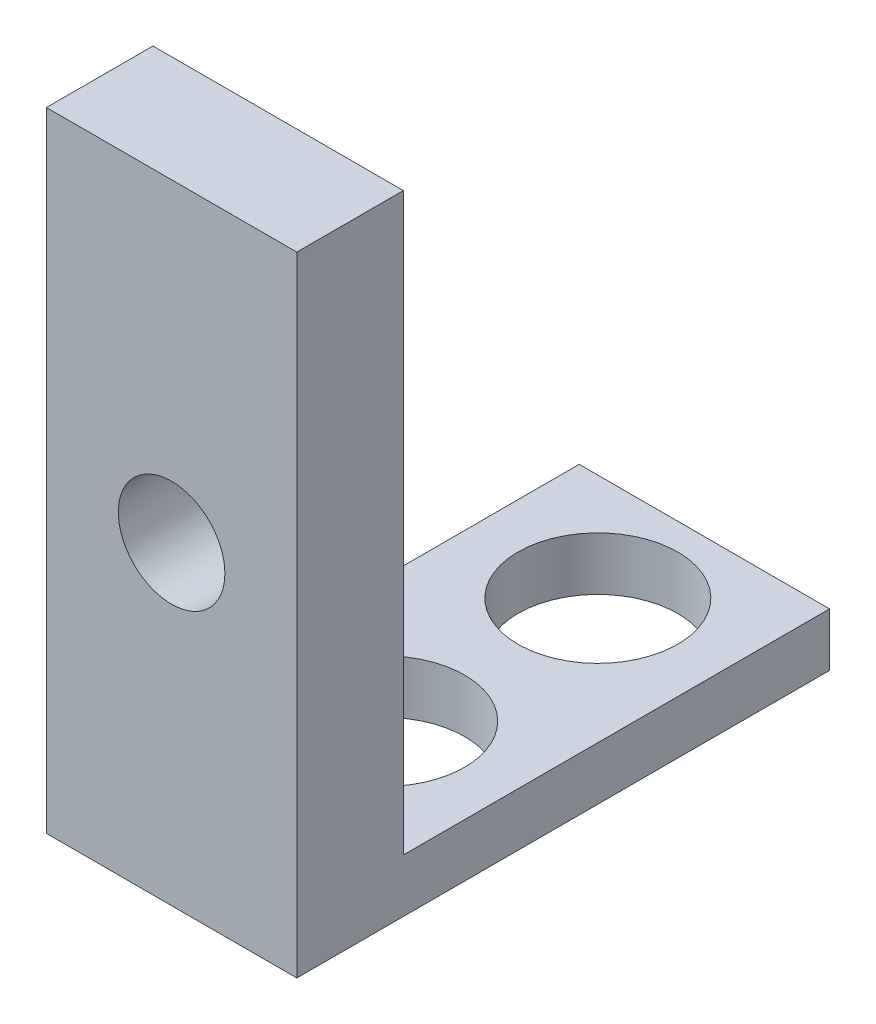
ISO-10303-21;
HEADER;
FILE_DESCRIPTION(('STEP AP214'),'2;1');
FILE_NAME('part.step','',(''),(''),'','','');
FILE_SCHEMA(('AUTOMOTIVE_DESIGN { 1 0 10303 214 1 1 1 1 }'));
ENDSEC;
DATA;
#1=APPLICATION_CONTEXT('core data for automotive mechanical design processes');
#2=APPLICATION_PROTOCOL_DEFINITION('international standard','automotive_design',2000,#1);
#3=PRODUCT_CONTEXT('',#1,'mechanical');
#4=PRODUCT('Part','Part','',(#3));
#5=PRODUCT_RELATED_PRODUCT_CATEGORY('part','',(#4));
#6=PRODUCT_DEFINITION_FORMATION('','',#4);
#7=PRODUCT_DEFINITION_CONTEXT('part definition',#1,'design');
#8=PRODUCT_DEFINITION('design','',#6,#7);
#9=PRODUCT_DEFINITION_SHAPE('','',#8);
#10=(LENGTH_UNIT() NAMED_UNIT(*) SI_UNIT(.MILLI.,.METRE.));
#11=(NAMED_UNIT(*) PLANE_ANGLE_UNIT() SI_UNIT($,.RADIAN.));
#12=(NAMED_UNIT(*) SI_UNIT($,.STERADIAN.) SOLID_ANGLE_UNIT());
#13=UNCERTAINTY_MEASURE_WITH_UNIT(LENGTH_MEASURE(1.E-05),#10,'distance_accuracy_value','');
#14=(GEOMETRIC_REPRESENTATION_CONTEXT(3) GLOBAL_UNCERTAINTY_ASSIGNED_CONTEXT((#13)) GLOBAL_UNIT_ASSIGNED_CONTEXT((#10,
#11,#12)) REPRESENTATION_CONTEXT('',''));
#15=CARTESIAN_POINT('',(0.,0.,0.));
#16=DIRECTION('',(0.,0.,1.));
#17=DIRECTION('',(1.,0.,0.));
#18=AXIS2_PLACEMENT_3D('',#15,#16,#17);
#19=CARTESIAN_POINT('',(0.,0.,0.));
#20=DIRECTION('',(0.,0.,1.));
#21=DIRECTION('',(1.,0.,0.));
#22=AXIS2_PLACEMENT_3D('',#19,#20,#21);
#23=PLANE('',#22);
#24=CARTESIAN_POINT('',(2.34999999999998,5.9,0.));
#25=DIRECTION('',(0.,0.,1.));
#26=DIRECTION('',(1.,0.,0.));
#27=AXIS2_PLACEMENT_3D('',#24,#25,#26);
#28=CIRCLE('',#27,1.);
#29=CARTESIAN_POINT('',(3.34999999999998,5.9,0.));
#30=VERTEX_POINT('',#29);
#31=EDGE_CURVE('E126',#30,#30,#28,.T.);
#32=ORIENTED_EDGE('',*,*,#31,.T.);
#33=EDGE_LOOP('',(#32));
#34=FACE_BOUND('',#33,.T.);
#35=DIRECTION('',(1.,0.,0.));
#36=VECTOR('',#35,1.);
#37=CARTESIAN_POINT('',(4.7,1.,0.));
#38=LINE('',#37,#36);
#39=CARTESIAN_POINT('',(0.,1.,0.));
#40=VERTEX_POINT('',#39);
#41=CARTESIAN_POINT('',(4.7,1.,0.));
#42=VERTEX_POINT('',#41);
#43=EDGE_CURVE('E48',#40,#42,#38,.T.);
#44=ORIENTED_EDGE('',*,*,#43,.F.);
#45=DIRECTION('',(0.,-1.,0.));
#46=VECTOR('',#45,1.);
#47=CARTESIAN_POINT('',(0.,0.,0.));
#48=LINE('',#47,#46);
#49=CARTESIAN_POINT('',(0.,11.8,0.));
#50=VERTEX_POINT('',#49);
#51=EDGE_CURVE('E135',#50,#40,#48,.T.);
#52=ORIENTED_EDGE('',*,*,#51,.F.);
#53=DIRECTION('',(-1.,0.,0.));
#54=VECTOR('',#53,1.);
#55=CARTESIAN_POINT('',(4.7,11.8,0.));
#56=LINE('',#55,#54);
#57=CARTESIAN_POINT('',(4.7,11.8,0.));
#58=VERTEX_POINT('',#57);
#59=EDGE_CURVE('E73',#58,#50,#56,.T.);
#60=ORIENTED_EDGE('',*,*,#59,.F.);
#61=DIRECTION('',(0.,1.,0.));
#62=VECTOR('',#61,1.);
#63=CARTESIAN_POINT('',(4.7,0.,0.));
#64=LINE('',#63,#62);
#65=EDGE_CURVE('E130',#42,#58,#64,.T.);
#66=ORIENTED_EDGE('',*,*,#65,.F.);
#67=EDGE_LOOP('',(#44,#52,#60,#66));
#68=FACE_BOUND('',#67,.T.);
#69=ADVANCED_FACE('F33',(#34,#68),#23,.F.);
#70=CARTESIAN_POINT('',(0.,0.,2.));
#71=DIRECTION('',(0.,0.,1.));
#72=DIRECTION('',(1.,0.,0.));
#73=AXIS2_PLACEMENT_3D('',#70,#71,#72);
#74=PLANE('',#73);
#75=DIRECTION('',(1.,0.,0.));
#76=VECTOR('',#75,1.);
#77=CARTESIAN_POINT('',(0.,0.,2.));
#78=LINE('',#77,#76);
#79=CARTESIAN_POINT('',(0.,0.,2.));
#80=VERTEX_POINT('',#79);
#81=CARTESIAN_POINT('',(4.7,0.,2.));
#82=VERTEX_POINT('',#81);
#83=EDGE_CURVE('E133',#80,#82,#78,.T.);
#84=ORIENTED_EDGE('',*,*,#83,.T.);
#85=DIRECTION('',(0.,1.,0.));
#86=VECTOR('',#85,1.);
#87=CARTESIAN_POINT('',(4.7,0.,2.));
#88=LINE('',#87,#86);
#89=CARTESIAN_POINT('',(4.7,11.8,2.));
#90=VERTEX_POINT('',#89);
#91=EDGE_CURVE('E80',#82,#90,#88,.T.);
#92=ORIENTED_EDGE('',*,*,#91,.T.);
#93=DIRECTION('',(-1.,0.,0.));
#94=VECTOR('',#93,1.);
#95=CARTESIAN_POINT('',(4.7,11.8,2.));
#96=LINE('',#95,#94);
#97=CARTESIAN_POINT('',(0.,11.8,2.));
#98=VERTEX_POINT('',#97);
#99=EDGE_CURVE('E137',#90,#98,#96,.T.);
#100=ORIENTED_EDGE('',*,*,#99,.T.);
#101=DIRECTION('',(0.,-1.,0.));
#102=VECTOR('',#101,1.);
#103=CARTESIAN_POINT('',(0.,0.,2.));
#104=LINE('',#103,#102);
#105=EDGE_CURVE('E57',#98,#80,#104,.T.);
#106=ORIENTED_EDGE('',*,*,#105,.T.);
#107=EDGE_LOOP('',(#84,#92,#100,#106));
#108=FACE_BOUND('',#107,.T.);
#109=CARTESIAN_POINT('',(2.34999999999998,5.9,2.));
#110=DIRECTION('',(0.,0.,1.));
#111=DIRECTION('',(1.,0.,0.));
#112=AXIS2_PLACEMENT_3D('',#109,#110,#111);
#113=CIRCLE('',#112,1.);
#114=CARTESIAN_POINT('',(3.34999999999998,5.9,2.));
#115=VERTEX_POINT('',#114);
#116=EDGE_CURVE('E127',#115,#115,#113,.T.);
#117=ORIENTED_EDGE('',*,*,#116,.F.);
#118=EDGE_LOOP('',(#117));
#119=FACE_BOUND('',#118,.T.);
#120=ADVANCED_FACE('F167',(#108,#119),#74,.T.);
#121=CARTESIAN_POINT('',(0.,0.,2.));
#122=DIRECTION('',(0.,1.,0.));
#123=DIRECTION('',(0.,0.,1.));
#124=AXIS2_PLACEMENT_3D('',#121,#122,#123);
#125=PLANE('',#124);
#126=CARTESIAN_POINT('',(2.34999999999998,0.,-2.));
#127=DIRECTION('',(0.,1.,0.));
#128=DIRECTION('',(0.,0.,1.));
#129=AXIS2_PLACEMENT_3D('',#126,#127,#128);
#130=CIRCLE('',#129,1.5);
#131=CARTESIAN_POINT('',(2.34999999999998,0.,-0.5));
#132=VERTEX_POINT('',#131);
#133=EDGE_CURVE('E114',#132,#132,#130,.T.);
#134=ORIENTED_EDGE('',*,*,#133,.T.);
#135=EDGE_LOOP('',(#134));
#136=FACE_BOUND('',#135,.T.);
#137=CARTESIAN_POINT('',(2.34999999999998,0.,-6.));
#138=DIRECTION('',(0.,1.,0.));
#139=DIRECTION('',(0.,0.,1.));
#140=AXIS2_PLACEMENT_3D('',#137,#138,#139);
#141=CIRCLE('',#140,1.5);
#142=CARTESIAN_POINT('',(2.34999999999998,0.,-4.5));
#143=VERTEX_POINT('',#142);
#144=EDGE_CURVE('E190',#143,#143,#141,.T.);
#145=ORIENTED_EDGE('',*,*,#144,.T.);
#146=EDGE_LOOP('',(#145));
#147=FACE_BOUND('',#146,.T.);
#148=DIRECTION('',(0.,0.,-1.));
#149=VECTOR('',#148,1.);
#150=CARTESIAN_POINT('',(0.,0.,2.));
#151=LINE('',#150,#149);
#152=CARTESIAN_POINT('',(0.,0.,-8.));
#153=VERTEX_POINT('',#152);
#154=EDGE_CURVE('E104',#80,#153,#151,.T.);
#155=ORIENTED_EDGE('',*,*,#154,.T.);
#156=DIRECTION('',(-1.,0.,0.));
#157=VECTOR('',#156,1.);
#158=CARTESIAN_POINT('',(4.7,0.,-8.));
#159=LINE('',#158,#157);
#160=CARTESIAN_POINT('',(4.7,0.,-8.));
#161=VERTEX_POINT('',#160);
#162=EDGE_CURVE('E103',#161,#153,#159,.T.);
#163=ORIENTED_EDGE('',*,*,#162,.F.);
#164=DIRECTION('',(0.,0.,-1.));
#165=VECTOR('',#164,1.);
#166=CARTESIAN_POINT('',(4.7,0.,2.));
#167=LINE('',#166,#165);
#168=EDGE_CURVE('E11',#82,#161,#167,.T.);
#169=ORIENTED_EDGE('',*,*,#168,.F.);
#170=ORIENTED_EDGE('',*,*,#83,.F.);
#171=EDGE_LOOP('',(#155,#163,#169,#170));
#172=FACE_BOUND('',#171,.T.);
#173=ADVANCED_FACE('F35',(#136,#147,#172),#125,.F.);
#174=CARTESIAN_POINT('',(4.7,0.,2.));
#175=DIRECTION('',(-1.,0.,0.));
#176=DIRECTION('',(0.,0.,1.));
#177=AXIS2_PLACEMENT_3D('',#174,#175,#176);
#178=PLANE('',#177);
#179=ORIENTED_EDGE('',*,*,#168,.T.);
#180=DIRECTION('',(0.,-1.,0.));
#181=VECTOR('',#180,1.);
#182=CARTESIAN_POINT('',(4.7,0.,-8.));
#183=LINE('',#182,#181);
#184=CARTESIAN_POINT('',(4.7,1.,-8.));
#185=VERTEX_POINT('',#184);
#186=EDGE_CURVE('E99',#185,#161,#183,.T.);
#187=ORIENTED_EDGE('',*,*,#186,.F.);
#188=DIRECTION('',(0.,0.,1.));
#189=VECTOR('',#188,1.);
#190=CARTESIAN_POINT('',(4.7,1.,-8.));
#191=LINE('',#190,#189);
#192=EDGE_CURVE('E120',#185,#42,#191,.T.);
#193=ORIENTED_EDGE('',*,*,#192,.T.);
#194=ORIENTED_EDGE('',*,*,#65,.T.);
#195=DIRECTION('',(0.,0.,-1.));
#196=VECTOR('',#195,1.);
#197=CARTESIAN_POINT('',(4.7,11.8,2.));
#198=LINE('',#197,#196);
#199=EDGE_CURVE('E41',#90,#58,#198,.T.);
#200=ORIENTED_EDGE('',*,*,#199,.F.);
#201=ORIENTED_EDGE('',*,*,#91,.F.);
#202=EDGE_LOOP('',(#179,#187,#193,#194,#200,#201));
#203=FACE_BOUND('',#202,.T.);
#204=ADVANCED_FACE('F96',(#203),#178,.F.);
#205=CARTESIAN_POINT('',(4.7,11.8,2.));
#206=DIRECTION('',(0.,-1.,0.));
#207=DIRECTION('',(1.,0.,0.));
#208=AXIS2_PLACEMENT_3D('',#205,#206,#207);
#209=PLANE('',#208);
#210=ORIENTED_EDGE('',*,*,#59,.T.);
#211=DIRECTION('',(0.,0.,-1.));
#212=VECTOR('',#211,1.);
#213=CARTESIAN_POINT('',(0.,11.8,2.));
#214=LINE('',#213,#212);
#215=EDGE_CURVE('E144',#98,#50,#214,.T.);
#216=ORIENTED_EDGE('',*,*,#215,.F.);
#217=ORIENTED_EDGE('',*,*,#99,.F.);
#218=ORIENTED_EDGE('',*,*,#199,.T.);
#219=EDGE_LOOP('',(#210,#216,#217,#218));
#220=FACE_BOUND('',#219,.T.);
#221=ADVANCED_FACE('F146',(#220),#209,.F.);
#222=CARTESIAN_POINT('',(0.,0.,2.));
#223=DIRECTION('',(1.,0.,0.));
#224=DIRECTION('',(0.,1.,0.));
#225=AXIS2_PLACEMENT_3D('',#222,#223,#224);
#226=PLANE('',#225);
#227=ORIENTED_EDGE('',*,*,#51,.T.);
#228=DIRECTION('',(0.,0.,1.));
#229=VECTOR('',#228,1.);
#230=CARTESIAN_POINT('',(0.,1.,-8.));
#231=LINE('',#230,#229);
#232=CARTESIAN_POINT('',(0.,1.,-8.));
#233=VERTEX_POINT('',#232);
#234=EDGE_CURVE('E123',#233,#40,#231,.T.);
#235=ORIENTED_EDGE('',*,*,#234,.F.);
#236=DIRECTION('',(0.,1.,0.));
#237=VECTOR('',#236,1.);
#238=CARTESIAN_POINT('',(0.,0.,-8.));
#239=LINE('',#238,#237);
#240=EDGE_CURVE('E107',#153,#233,#239,.T.);
#241=ORIENTED_EDGE('',*,*,#240,.F.);
#242=ORIENTED_EDGE('',*,*,#154,.F.);
#243=ORIENTED_EDGE('',*,*,#105,.F.);
#244=ORIENTED_EDGE('',*,*,#215,.T.);
#245=EDGE_LOOP('',(#227,#235,#241,#242,#243,#244));
#246=FACE_BOUND('',#245,.T.);
#247=ADVANCED_FACE('F149',(#246),#226,.F.);
#248=CARTESIAN_POINT('',(2.34999999999998,5.9,2.));
#249=DIRECTION('',(0.,0.,-1.));
#250=DIRECTION('',(-1.,0.,0.));
#251=AXIS2_PLACEMENT_3D('',#248,#249,#250);
#252=CYLINDRICAL_SURFACE('',#251,1.);
#253=ORIENTED_EDGE('',*,*,#116,.T.);
#254=EDGE_LOOP('',(#253));
#255=FACE_BOUND('',#254,.T.);
#256=ORIENTED_EDGE('',*,*,#31,.F.);
#257=EDGE_LOOP('',(#256));
#258=FACE_BOUND('',#257,.T.);
#259=ADVANCED_FACE('F153',(#255,#258),#252,.F.);
#260=CARTESIAN_POINT('',(4.7,1.,-8.));
#261=DIRECTION('',(0.,-1.,0.));
#262=DIRECTION('',(1.,0.,0.));
#263=AXIS2_PLACEMENT_3D('',#260,#261,#262);
#264=PLANE('',#263);
#265=CARTESIAN_POINT('',(2.34999999999998,1.,-2.));
#266=DIRECTION('',(0.,1.,0.));
#267=DIRECTION('',(-1.,0.,0.));
#268=AXIS2_PLACEMENT_3D('',#265,#266,#267);
#269=CIRCLE('',#268,1.5);
#270=CARTESIAN_POINT('',(0.849999999999979,1.,-2.));
#271=VERTEX_POINT('',#270);
#272=EDGE_CURVE('E192',#271,#271,#269,.T.);
#273=ORIENTED_EDGE('',*,*,#272,.F.);
#274=EDGE_LOOP('',(#273));
#275=FACE_BOUND('',#274,.T.);
#276=CARTESIAN_POINT('',(2.34999999999998,1.,-6.));
#277=DIRECTION('',(0.,1.,0.));
#278=DIRECTION('',(-1.,0.,0.));
#279=AXIS2_PLACEMENT_3D('',#276,#277,#278);
#280=CIRCLE('',#279,1.5);
#281=CARTESIAN_POINT('',(0.849999999999979,1.,-6.));
#282=VERTEX_POINT('',#281);
#283=EDGE_CURVE('E194',#282,#282,#280,.T.);
#284=ORIENTED_EDGE('',*,*,#283,.F.);
#285=EDGE_LOOP('',(#284));
#286=FACE_BOUND('',#285,.T.);
#287=ORIENTED_EDGE('',*,*,#43,.T.);
#288=ORIENTED_EDGE('',*,*,#192,.F.);
#289=DIRECTION('',(1.,0.,0.));
#290=VECTOR('',#289,1.);
#291=CARTESIAN_POINT('',(4.7,1.,-8.));
#292=LINE('',#291,#290);
#293=EDGE_CURVE('E111',#233,#185,#292,.T.);
#294=ORIENTED_EDGE('',*,*,#293,.F.);
#295=ORIENTED_EDGE('',*,*,#234,.T.);
#296=EDGE_LOOP('',(#287,#288,#294,#295));
#297=FACE_BOUND('',#296,.T.);
#298=ADVANCED_FACE('F151',(#275,#286,#297),#264,.F.);
#299=CARTESIAN_POINT('',(0.,0.,-8.));
#300=DIRECTION('',(0.,0.,1.));
#301=DIRECTION('',(1.,0.,0.));
#302=AXIS2_PLACEMENT_3D('',#299,#300,#301);
#303=PLANE('',#302);
#304=ORIENTED_EDGE('',*,*,#186,.T.);
#305=ORIENTED_EDGE('',*,*,#162,.T.);
#306=ORIENTED_EDGE('',*,*,#240,.T.);
#307=ORIENTED_EDGE('',*,*,#293,.T.);
#308=EDGE_LOOP('',(#304,#305,#306,#307));
#309=FACE_BOUND('',#308,.T.);
#310=ADVANCED_FACE('F109',(#309),#303,.F.);
#311=CARTESIAN_POINT('',(2.34999999999998,-7.,-6.));
#312=DIRECTION('',(0.,1.,0.));
#313=DIRECTION('',(-1.,0.,0.));
#314=AXIS2_PLACEMENT_3D('',#311,#312,#313);
#315=CYLINDRICAL_SURFACE('',#314,1.5);
#316=ORIENTED_EDGE('',*,*,#283,.T.);
#317=EDGE_LOOP('',(#316));
#318=FACE_BOUND('',#317,.T.);
#319=ORIENTED_EDGE('',*,*,#144,.F.);
#320=EDGE_LOOP('',(#319));
#321=FACE_BOUND('',#320,.T.);
#322=ADVANCED_FACE('F160',(#318,#321),#315,.F.);
#323=CARTESIAN_POINT('',(2.34999999999998,-7.,-2.));
#324=DIRECTION('',(0.,1.,0.));
#325=DIRECTION('',(-1.,0.,0.));
#326=AXIS2_PLACEMENT_3D('',#323,#324,#325);
#327=CYLINDRICAL_SURFACE('',#326,1.5);
#328=ORIENTED_EDGE('',*,*,#272,.T.);
#329=EDGE_LOOP('',(#328));
#330=FACE_BOUND('',#329,.T.);
#331=ORIENTED_EDGE('',*,*,#133,.F.);
#332=EDGE_LOOP('',(#331));
#333=FACE_BOUND('',#332,.T.);
#334=ADVANCED_FACE('F201',(#330,#333),#327,.F.);
#335=CLOSED_SHELL('',(#69,#120,#173,#204,#221,#247,#259,#298,#310,#322,#334));
#336=MANIFOLD_SOLID_BREP('B2',#335);
#337=ADVANCED_BREP_SHAPE_REPRESENTATION('',(#18,#336),#14);
#338=SHAPE_DEFINITION_REPRESENTATION(#9,#337);
ENDSEC;
END-ISO-10303-21;
